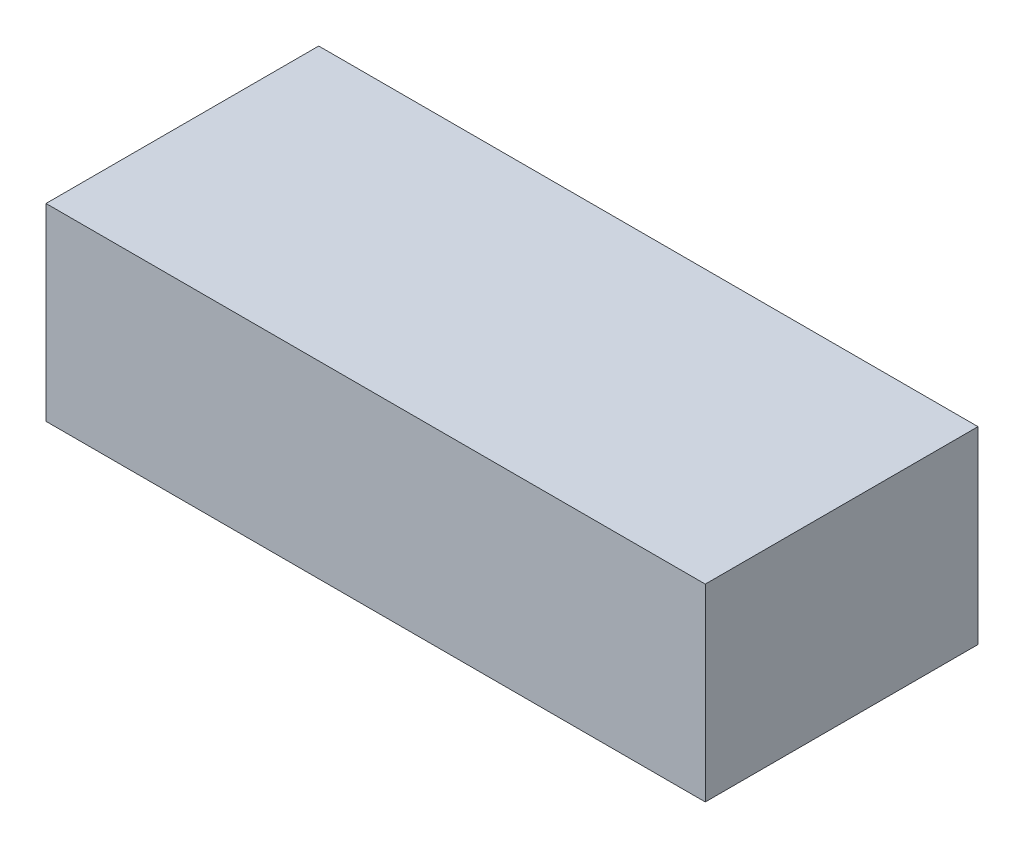
ISO-10303-21;
HEADER;
FILE_DESCRIPTION(('STEP AP214'),'2;1');
FILE_NAME('part.step','',(''),(''),'','','');
FILE_SCHEMA(('AUTOMOTIVE_DESIGN { 1 0 10303 214 1 1 1 1 }'));
ENDSEC;
DATA;
#1=APPLICATION_CONTEXT('core data for automotive mechanical design processes');
#2=APPLICATION_PROTOCOL_DEFINITION('international standard','automotive_design',2000,#1);
#3=PRODUCT_CONTEXT('',#1,'mechanical');
#4=PRODUCT('Part','Part','',(#3));
#5=PRODUCT_RELATED_PRODUCT_CATEGORY('part','',(#4));
#6=PRODUCT_DEFINITION_FORMATION('','',#4);
#7=PRODUCT_DEFINITION_CONTEXT('part definition',#1,'design');
#8=PRODUCT_DEFINITION('design','',#6,#7);
#9=PRODUCT_DEFINITION_SHAPE('','',#8);
#10=(LENGTH_UNIT() NAMED_UNIT(*) SI_UNIT(.MILLI.,.METRE.));
#11=(NAMED_UNIT(*) PLANE_ANGLE_UNIT() SI_UNIT($,.RADIAN.));
#12=(NAMED_UNIT(*) SI_UNIT($,.STERADIAN.) SOLID_ANGLE_UNIT());
#13=UNCERTAINTY_MEASURE_WITH_UNIT(LENGTH_MEASURE(1.E-05),#10,'distance_accuracy_value','');
#14=(GEOMETRIC_REPRESENTATION_CONTEXT(3) GLOBAL_UNCERTAINTY_ASSIGNED_CONTEXT((#13)) GLOBAL_UNIT_ASSIGNED_CONTEXT((#10,
#11,#12)) REPRESENTATION_CONTEXT('',''));
#15=CARTESIAN_POINT('',(0.,0.,0.));
#16=DIRECTION('',(0.,0.,1.));
#17=DIRECTION('',(1.,0.,0.));
#18=AXIS2_PLACEMENT_3D('',#15,#16,#17);
#19=CARTESIAN_POINT('',(35.052,20.066,14.5));
#20=DIRECTION('',(-1.,0.,0.));
#21=DIRECTION('',(0.,0.,1.));
#22=AXIS2_PLACEMENT_3D('',#19,#20,#21);
#23=PLANE('',#22);
#24=DIRECTION('',(0.,0.,-1.));
#25=VECTOR('',#24,1.);
#26=CARTESIAN_POINT('',(35.052,0.,14.5));
#27=LINE('',#26,#25);
#28=CARTESIAN_POINT('',(35.052,0.,14.5));
#29=VERTEX_POINT('',#28);
#30=CARTESIAN_POINT('',(35.052,0.,-14.5));
#31=VERTEX_POINT('',#30);
#32=EDGE_CURVE('E113',#29,#31,#27,.T.);
#33=ORIENTED_EDGE('',*,*,#32,.T.);
#34=DIRECTION('',(0.,-1.,0.));
#35=VECTOR('',#34,1.);
#36=CARTESIAN_POINT('',(35.052,20.066,-14.5));
#37=LINE('',#36,#35);
#38=CARTESIAN_POINT('',(35.052,20.066,-14.5));
#39=VERTEX_POINT('',#38);
#40=EDGE_CURVE('E11',#39,#31,#37,.T.);
#41=ORIENTED_EDGE('',*,*,#40,.F.);
#42=DIRECTION('',(0.,0.,-1.));
#43=VECTOR('',#42,1.);
#44=CARTESIAN_POINT('',(35.052,20.066,14.5));
#45=LINE('',#44,#43);
#46=CARTESIAN_POINT('',(35.052,20.066,14.5));
#47=VERTEX_POINT('',#46);
#48=EDGE_CURVE('E97',#47,#39,#45,.T.);
#49=ORIENTED_EDGE('',*,*,#48,.F.);
#50=DIRECTION('',(0.,-1.,0.));
#51=VECTOR('',#50,1.);
#52=CARTESIAN_POINT('',(35.052,20.066,14.5));
#53=LINE('',#52,#51);
#54=EDGE_CURVE('E109',#47,#29,#53,.T.);
#55=ORIENTED_EDGE('',*,*,#54,.T.);
#56=EDGE_LOOP('',(#33,#41,#49,#55));
#57=FACE_BOUND('',#56,.T.);
#58=ADVANCED_FACE('F45',(#57),#23,.F.);
#59=CARTESIAN_POINT('',(-35.052,20.066,-14.5));
#60=DIRECTION('',(0.,0.,1.));
#61=DIRECTION('',(1.,0.,0.));
#62=AXIS2_PLACEMENT_3D('',#59,#60,#61);
#63=PLANE('',#62);
#64=DIRECTION('',(-1.,0.,0.));
#65=VECTOR('',#64,1.);
#66=CARTESIAN_POINT('',(-35.052,0.,-14.5));
#67=LINE('',#66,#65);
#68=CARTESIAN_POINT('',(-35.052,0.,-14.5));
#69=VERTEX_POINT('',#68);
#70=EDGE_CURVE('E102',#31,#69,#67,.T.);
#71=ORIENTED_EDGE('',*,*,#70,.T.);
#72=DIRECTION('',(0.,-1.,0.));
#73=VECTOR('',#72,1.);
#74=CARTESIAN_POINT('',(-35.052,20.066,-14.5));
#75=LINE('',#74,#73);
#76=CARTESIAN_POINT('',(-35.052,20.066,-14.5));
#77=VERTEX_POINT('',#76);
#78=EDGE_CURVE('E54',#77,#69,#75,.T.);
#79=ORIENTED_EDGE('',*,*,#78,.F.);
#80=DIRECTION('',(-1.,0.,0.));
#81=VECTOR('',#80,1.);
#82=CARTESIAN_POINT('',(-35.052,20.066,-14.5));
#83=LINE('',#82,#81);
#84=EDGE_CURVE('E92',#39,#77,#83,.T.);
#85=ORIENTED_EDGE('',*,*,#84,.F.);
#86=ORIENTED_EDGE('',*,*,#40,.T.);
#87=EDGE_LOOP('',(#71,#79,#85,#86));
#88=FACE_BOUND('',#87,.T.);
#89=ADVANCED_FACE('F101',(#88),#63,.F.);
#90=CARTESIAN_POINT('',(-35.052,20.066,14.5));
#91=DIRECTION('',(1.,0.,0.));
#92=DIRECTION('',(0.,0.,-1.));
#93=AXIS2_PLACEMENT_3D('',#90,#91,#92);
#94=PLANE('',#93);
#95=DIRECTION('',(0.,0.,1.));
#96=VECTOR('',#95,1.);
#97=CARTESIAN_POINT('',(-35.052,0.,14.5));
#98=LINE('',#97,#96);
#99=CARTESIAN_POINT('',(-35.052,0.,14.5));
#100=VERTEX_POINT('',#99);
#101=EDGE_CURVE('E79',#69,#100,#98,.T.);
#102=ORIENTED_EDGE('',*,*,#101,.T.);
#103=DIRECTION('',(0.,-1.,0.));
#104=VECTOR('',#103,1.);
#105=CARTESIAN_POINT('',(-35.052,20.066,14.5));
#106=LINE('',#105,#104);
#107=CARTESIAN_POINT('',(-35.052,20.066,14.5));
#108=VERTEX_POINT('',#107);
#109=EDGE_CURVE('E104',#108,#100,#106,.T.);
#110=ORIENTED_EDGE('',*,*,#109,.F.);
#111=DIRECTION('',(0.,0.,1.));
#112=VECTOR('',#111,1.);
#113=CARTESIAN_POINT('',(-35.052,20.066,14.5));
#114=LINE('',#113,#112);
#115=EDGE_CURVE('E95',#77,#108,#114,.T.);
#116=ORIENTED_EDGE('',*,*,#115,.F.);
#117=ORIENTED_EDGE('',*,*,#78,.T.);
#118=EDGE_LOOP('',(#102,#110,#116,#117));
#119=FACE_BOUND('',#118,.T.);
#120=ADVANCED_FACE('F105',(#119),#94,.F.);
#121=CARTESIAN_POINT('',(-35.052,20.066,14.5));
#122=DIRECTION('',(0.,0.,-1.));
#123=DIRECTION('',(-1.,0.,0.));
#124=AXIS2_PLACEMENT_3D('',#121,#122,#123);
#125=PLANE('',#124);
#126=DIRECTION('',(1.,0.,0.));
#127=VECTOR('',#126,1.);
#128=CARTESIAN_POINT('',(-35.052,0.,14.5));
#129=LINE('',#128,#127);
#130=EDGE_CURVE('E85',#100,#29,#129,.T.);
#131=ORIENTED_EDGE('',*,*,#130,.T.);
#132=ORIENTED_EDGE('',*,*,#54,.F.);
#133=DIRECTION('',(1.,0.,0.));
#134=VECTOR('',#133,1.);
#135=CARTESIAN_POINT('',(-35.052,20.066,14.5));
#136=LINE('',#135,#134);
#137=EDGE_CURVE('E62',#108,#47,#136,.T.);
#138=ORIENTED_EDGE('',*,*,#137,.F.);
#139=ORIENTED_EDGE('',*,*,#109,.T.);
#140=EDGE_LOOP('',(#131,#132,#138,#139));
#141=FACE_BOUND('',#140,.T.);
#142=ADVANCED_FACE('F126',(#141),#125,.F.);
#143=CARTESIAN_POINT('',(0.,20.066,0.));
#144=DIRECTION('',(0.,-1.,0.));
#145=DIRECTION('',(0.,0.,-1.));
#146=AXIS2_PLACEMENT_3D('',#143,#144,#145);
#147=PLANE('',#146);
#148=ORIENTED_EDGE('',*,*,#48,.T.);
#149=ORIENTED_EDGE('',*,*,#84,.T.);
#150=ORIENTED_EDGE('',*,*,#115,.T.);
#151=ORIENTED_EDGE('',*,*,#137,.T.);
#152=EDGE_LOOP('',(#148,#149,#150,#151));
#153=FACE_BOUND('',#152,.T.);
#154=ADVANCED_FACE('F93',(#153),#147,.F.);
#155=CARTESIAN_POINT('',(0.,0.,0.));
#156=DIRECTION('',(0.,-1.,0.));
#157=DIRECTION('',(0.,0.,-1.));
#158=AXIS2_PLACEMENT_3D('',#155,#156,#157);
#159=PLANE('',#158);
#160=ORIENTED_EDGE('',*,*,#32,.F.);
#161=ORIENTED_EDGE('',*,*,#130,.F.);
#162=ORIENTED_EDGE('',*,*,#101,.F.);
#163=ORIENTED_EDGE('',*,*,#70,.F.);
#164=EDGE_LOOP('',(#160,#161,#162,#163));
#165=FACE_BOUND('',#164,.T.);
#166=ADVANCED_FACE('F129',(#165),#159,.T.);
#167=CLOSED_SHELL('',(#58,#89,#120,#142,#154,#166));
#168=MANIFOLD_SOLID_BREP('B2',#167);
#169=ADVANCED_BREP_SHAPE_REPRESENTATION('',(#18,#168),#14);
#170=SHAPE_DEFINITION_REPRESENTATION(#9,#169);
ENDSEC;
END-ISO-10303-21;
